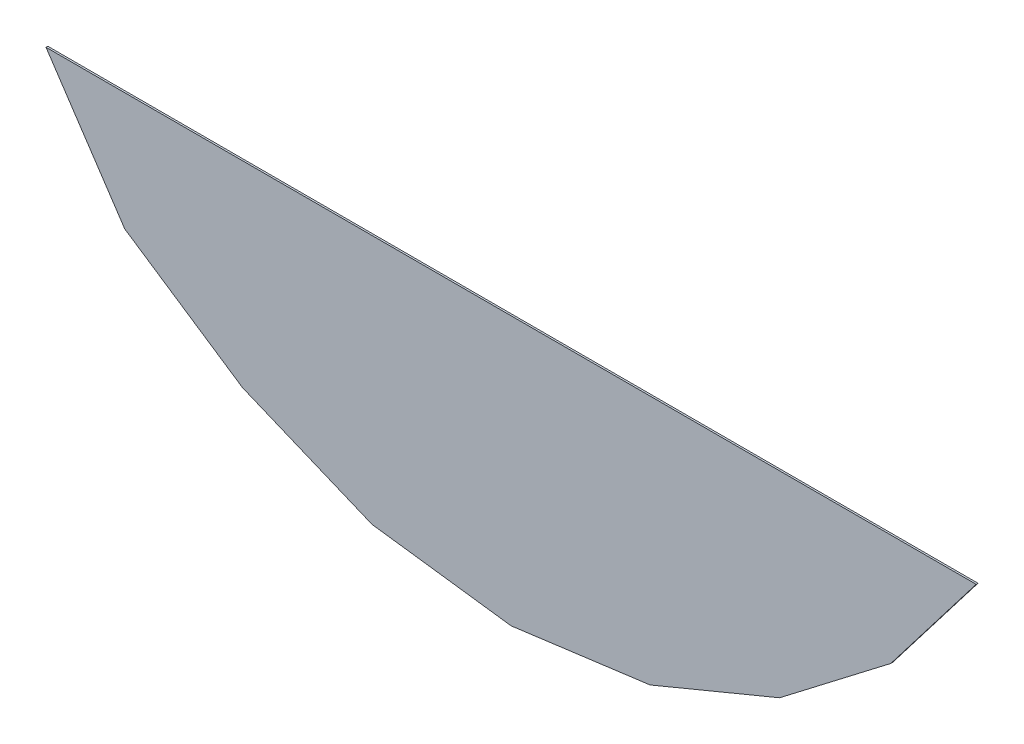
ISO-10303-21;
HEADER;
FILE_DESCRIPTION(('STEP AP214'),'2;1');
FILE_NAME('part.step','',(''),(''),'','','');
FILE_SCHEMA(('AUTOMOTIVE_DESIGN { 1 0 10303 214 1 1 1 1 }'));
ENDSEC;
DATA;
#1=APPLICATION_CONTEXT('core data for automotive mechanical design processes');
#2=APPLICATION_PROTOCOL_DEFINITION('international standard','automotive_design',2000,#1);
#3=PRODUCT_CONTEXT('',#1,'mechanical');
#4=PRODUCT('Part','Part','',(#3));
#5=PRODUCT_RELATED_PRODUCT_CATEGORY('part','',(#4));
#6=PRODUCT_DEFINITION_FORMATION('','',#4);
#7=PRODUCT_DEFINITION_CONTEXT('part definition',#1,'design');
#8=PRODUCT_DEFINITION('design','',#6,#7);
#9=PRODUCT_DEFINITION_SHAPE('','',#8);
#10=(LENGTH_UNIT() NAMED_UNIT(*) SI_UNIT(.MILLI.,.METRE.));
#11=(NAMED_UNIT(*) PLANE_ANGLE_UNIT() SI_UNIT($,.RADIAN.));
#12=(NAMED_UNIT(*) SI_UNIT($,.STERADIAN.) SOLID_ANGLE_UNIT());
#13=UNCERTAINTY_MEASURE_WITH_UNIT(LENGTH_MEASURE(1.E-05),#10,'distance_accuracy_value','');
#14=(GEOMETRIC_REPRESENTATION_CONTEXT(3) GLOBAL_UNCERTAINTY_ASSIGNED_CONTEXT((#13)) GLOBAL_UNIT_ASSIGNED_CONTEXT((#10,
#11,#12)) REPRESENTATION_CONTEXT('',''));
#15=CARTESIAN_POINT('',(0.,0.,0.));
#16=DIRECTION('',(0.,0.,1.));
#17=DIRECTION('',(1.,0.,0.));
#18=AXIS2_PLACEMENT_3D('',#15,#16,#17);
#19=CARTESIAN_POINT('',(-2.55477772,-4.28920148,3.9099998));
#20=DIRECTION('',(0.,0.,1.));
#21=DIRECTION('',(1.,0.,0.));
#22=AXIS2_PLACEMENT_3D('',#19,#20,#21);
#23=PLANE('',#22);
#24=DIRECTION('',(0.608760808228314,0.793353816632409,0.));
#25=VECTOR('',#24,1.);
#26=CARTESIAN_POINT('',(2.55477264,-4.28920148,3.9099998));
#27=LINE('',#26,#25);
#28=CARTESIAN_POINT('',(2.55477264,-4.28920148,3.9099998));
#29=VERTEX_POINT('',#28);
#30=CARTESIAN_POINT('',(2.08596230000002,-4.90016800000001,3.9099998));
#31=VERTEX_POINT('',#30);
#32=EDGE_CURVE('E126',#29,#31,#27,.F.);
#33=ORIENTED_EDGE('',*,*,#32,.F.);
#34=DIRECTION('',(1.,0.,0.));
#35=VECTOR('',#34,1.);
#36=CARTESIAN_POINT('',(-2.55477772,-4.28920148,3.9099998));
#37=LINE('',#36,#35);
#38=CARTESIAN_POINT('',(-2.55477772000007,-4.28920148000005,3.9099998));
#39=VERTEX_POINT('',#38);
#40=EDGE_CURVE('E99',#39,#29,#37,.T.);
#41=ORIENTED_EDGE('',*,*,#40,.F.);
#42=DIRECTION('',(0.555139797690197,-0.831757058894295,0.));
#43=VECTOR('',#42,1.);
#44=CARTESIAN_POINT('',(-2.12257132,-4.9367694,3.9099998));
#45=LINE('',#44,#43);
#46=CARTESIAN_POINT('',(-2.12257131999998,-4.93676939999997,3.9099998));
#47=VERTEX_POINT('',#46);
#48=EDGE_CURVE('E19',#47,#39,#45,.F.);
#49=ORIENTED_EDGE('',*,*,#48,.F.);
#50=DIRECTION('',(0.831757058894295,-0.555139797690197,0.));
#51=VECTOR('',#50,1.);
#52=CARTESIAN_POINT('',(-1.4750034,-5.3689758,3.9099998));
#53=LINE('',#52,#51);
#54=CARTESIAN_POINT('',(-1.47500340000004,-5.36897580000008,3.9099998));
#55=VERTEX_POINT('',#54);
#56=EDGE_CURVE('E88',#55,#47,#53,.F.);
#57=ORIENTED_EDGE('',*,*,#56,.F.);
#58=DIRECTION('',(0.923879753352857,-0.382682899205941,0.));
#59=VECTOR('',#58,1.);
#60=CARTESIAN_POINT('',(-0.76351892,-5.66368184,3.9099998));
#61=LINE('',#60,#59);
#62=CARTESIAN_POINT('',(-0.763518920000012,-5.66368184000008,3.9099998));
#63=VERTEX_POINT('',#62);
#64=EDGE_CURVE('E83',#63,#55,#61,.F.);
#65=ORIENTED_EDGE('',*,*,#64,.F.);
#66=DIRECTION('',(0.991445008976821,-0.130525071058976,0.));
#67=VECTOR('',#66,1.);
#68=CARTESIAN_POINT('',(-2.539999996998E-06,-5.7641998,3.9099998));
#69=LINE('',#68,#67);
#70=CARTESIAN_POINT('',(-2.5400000081571E-06,-5.76419979999992,3.9099998));
#71=VERTEX_POINT('',#70);
#72=EDGE_CURVE('E110',#71,#63,#69,.F.);
#73=ORIENTED_EDGE('',*,*,#72,.F.);
#74=DIRECTION('',(0.991445008976821,0.130525071058976,0.));
#75=VECTOR('',#74,1.);
#76=CARTESIAN_POINT('',(0.76351384,-5.66368184,3.9099998));
#77=LINE('',#76,#75);
#78=CARTESIAN_POINT('',(0.763513839999964,-5.66368183999992,3.9099998));
#79=VERTEX_POINT('',#78);
#80=EDGE_CURVE('E114',#79,#71,#77,.F.);
#81=ORIENTED_EDGE('',*,*,#80,.F.);
#82=DIRECTION('',(0.923879753352857,0.382682899205941,0.));
#83=VECTOR('',#82,1.);
#84=CARTESIAN_POINT('',(1.47499832,-5.3689758,3.9099998));
#85=LINE('',#84,#83);
#86=CARTESIAN_POINT('',(1.47499832000001,-5.36897580000001,3.9099998));
#87=VERTEX_POINT('',#86);
#88=EDGE_CURVE('E118',#87,#79,#85,.F.);
#89=ORIENTED_EDGE('',*,*,#88,.F.);
#90=DIRECTION('',(0.793354187267769,0.608760325205822,0.));
#91=VECTOR('',#90,1.);
#92=CARTESIAN_POINT('',(2.0859623,-4.900168,3.9099998));
#93=LINE('',#92,#91);
#94=EDGE_CURVE('E122',#31,#87,#93,.F.);
#95=ORIENTED_EDGE('',*,*,#94,.F.);
#96=EDGE_LOOP('',(#33,#41,#49,#57,#65,#73,#81,#89,#95));
#97=FACE_BOUND('',#96,.T.);
#98=ADVANCED_FACE('F16',(#97),#23,.T.);
#99=CARTESIAN_POINT('',(-2.12257132,-4.9367694,3.89999982));
#100=DIRECTION('',(-0.831757058894295,-0.555139797690197,0.));
#101=DIRECTION('',(0.555139797690197,-0.831757058894295,0.));
#102=AXIS2_PLACEMENT_3D('',#99,#100,#101);
#103=PLANE('',#102);
#104=DIRECTION('',(0.,0.,1.));
#105=VECTOR('',#104,1.);
#106=CARTESIAN_POINT('',(-2.55477772,-4.28920148,3.89999982));
#107=LINE('',#106,#105);
#108=CARTESIAN_POINT('',(-2.55477772000007,-4.28920148000005,3.89999982));
#109=VERTEX_POINT('',#108);
#110=EDGE_CURVE('E130',#109,#39,#107,.T.);
#111=ORIENTED_EDGE('',*,*,#110,.F.);
#112=DIRECTION('',(0.555139797690014,-0.831757058894417,0.));
#113=VECTOR('',#112,1.);
#114=CARTESIAN_POINT('',(-2.55477772,-4.28920148,3.89999982));
#115=LINE('',#114,#113);
#116=CARTESIAN_POINT('',(-2.12257131999998,-4.93676939999997,3.89999982));
#117=VERTEX_POINT('',#116);
#118=EDGE_CURVE('E105',#109,#117,#115,.T.);
#119=ORIENTED_EDGE('',*,*,#118,.T.);
#120=DIRECTION('',(0.,0.,1.));
#121=VECTOR('',#120,1.);
#122=CARTESIAN_POINT('',(-2.12257131999991,-4.93676939999986,3.89999982));
#123=LINE('',#122,#121);
#124=EDGE_CURVE('E93',#47,#117,#123,.F.);
#125=ORIENTED_EDGE('',*,*,#124,.F.);
#126=ORIENTED_EDGE('',*,*,#48,.T.);
#127=EDGE_LOOP('',(#111,#119,#125,#126));
#128=FACE_BOUND('',#127,.T.);
#129=ADVANCED_FACE('F104',(#128),#103,.T.);
#130=CARTESIAN_POINT('',(-1.4750034,-5.3689758,3.89999982));
#131=DIRECTION('',(-0.555139797690197,-0.831757058894295,0.));
#132=DIRECTION('',(0.831757058894295,-0.555139797690197,0.));
#133=AXIS2_PLACEMENT_3D('',#130,#131,#132);
#134=PLANE('',#133);
#135=ORIENTED_EDGE('',*,*,#124,.T.);
#136=DIRECTION('',(0.831757058894417,-0.555139797690014,0.));
#137=VECTOR('',#136,1.);
#138=CARTESIAN_POINT('',(-2.12257132,-4.9367694,3.89999982));
#139=LINE('',#138,#137);
#140=CARTESIAN_POINT('',(-1.47500340000004,-5.36897580000008,3.89999982));
#141=VERTEX_POINT('',#140);
#142=EDGE_CURVE('E135',#117,#141,#139,.T.);
#143=ORIENTED_EDGE('',*,*,#142,.T.);
#144=DIRECTION('',(0.,0.,1.));
#145=VECTOR('',#144,1.);
#146=CARTESIAN_POINT('',(-1.47500340000014,-5.36897580000034,3.89999982));
#147=LINE('',#146,#145);
#148=EDGE_CURVE('E95',#55,#141,#147,.F.);
#149=ORIENTED_EDGE('',*,*,#148,.F.);
#150=ORIENTED_EDGE('',*,*,#56,.T.);
#151=EDGE_LOOP('',(#135,#143,#149,#150));
#152=FACE_BOUND('',#151,.T.);
#153=ADVANCED_FACE('F90',(#152),#134,.T.);
#154=CARTESIAN_POINT('',(-0.76351892,-5.66368184,3.89999982));
#155=DIRECTION('',(-0.382682899205941,-0.923879753352857,0.));
#156=DIRECTION('',(0.923879753352857,-0.382682899205941,0.));
#157=AXIS2_PLACEMENT_3D('',#154,#155,#156);
#158=PLANE('',#157);
#159=ORIENTED_EDGE('',*,*,#148,.T.);
#160=DIRECTION('',(0.923879753352675,-0.382682899206379,0.));
#161=VECTOR('',#160,1.);
#162=CARTESIAN_POINT('',(-1.4750034,-5.3689758,3.89999982));
#163=LINE('',#162,#161);
#164=CARTESIAN_POINT('',(-0.763518920000012,-5.66368184000008,3.89999982));
#165=VERTEX_POINT('',#164);
#166=EDGE_CURVE('E137',#141,#165,#163,.T.);
#167=ORIENTED_EDGE('',*,*,#166,.T.);
#168=DIRECTION('',(0.,0.,1.));
#169=VECTOR('',#168,1.);
#170=CARTESIAN_POINT('',(-0.763518920000045,-5.66368184000034,3.89999982));
#171=LINE('',#170,#169);
#172=EDGE_CURVE('E112',#63,#165,#171,.F.);
#173=ORIENTED_EDGE('',*,*,#172,.F.);
#174=ORIENTED_EDGE('',*,*,#64,.T.);
#175=EDGE_LOOP('',(#159,#167,#173,#174));
#176=FACE_BOUND('',#175,.T.);
#177=ADVANCED_FACE('F179',(#176),#158,.T.);
#178=CARTESIAN_POINT('',(-2.539999996998E-06,-5.7641998,3.89999982));
#179=DIRECTION('',(-0.130525071058976,-0.991445008976821,0.));
#180=DIRECTION('',(0.991445008976821,-0.130525071058976,0.));
#181=AXIS2_PLACEMENT_3D('',#178,#179,#180);
#182=PLANE('',#181);
#183=ORIENTED_EDGE('',*,*,#172,.T.);
#184=DIRECTION('',(0.991445008976764,-0.130525071059414,0.));
#185=VECTOR('',#184,1.);
#186=CARTESIAN_POINT('',(-0.76351892,-5.66368184,3.89999982));
#187=LINE('',#186,#185);
#188=CARTESIAN_POINT('',(-2.54000000815547E-06,-5.76419979999992,3.89999982));
#189=VERTEX_POINT('',#188);
#190=EDGE_CURVE('E140',#165,#189,#187,.T.);
#191=ORIENTED_EDGE('',*,*,#190,.T.);
#192=DIRECTION('',(0.,0.,1.));
#193=VECTOR('',#192,1.);
#194=CARTESIAN_POINT('',(-2.5400000415671E-06,-5.76419979999966,3.89999982));
#195=LINE('',#194,#193);
#196=EDGE_CURVE('E116',#71,#189,#195,.F.);
#197=ORIENTED_EDGE('',*,*,#196,.F.);
#198=ORIENTED_EDGE('',*,*,#72,.T.);
#199=EDGE_LOOP('',(#183,#191,#197,#198));
#200=FACE_BOUND('',#199,.T.);
#201=ADVANCED_FACE('F177',(#200),#182,.T.);
#202=CARTESIAN_POINT('',(0.76351384,-5.66368184,3.89999982));
#203=DIRECTION('',(0.130525071058976,-0.991445008976821,0.));
#204=DIRECTION('',(0.991445008976821,0.130525071058976,0.));
#205=AXIS2_PLACEMENT_3D('',#202,#203,#204);
#206=PLANE('',#205);
#207=ORIENTED_EDGE('',*,*,#196,.T.);
#208=DIRECTION('',(0.991445008976763,0.130525071059415,0.));
#209=VECTOR('',#208,1.);
#210=CARTESIAN_POINT('',(-2.53999999678955E-06,-5.7641998,3.89999982));
#211=LINE('',#210,#209);
#212=CARTESIAN_POINT('',(0.763513839999964,-5.66368183999992,3.89999982));
#213=VERTEX_POINT('',#212);
#214=EDGE_CURVE('E143',#189,#213,#211,.T.);
#215=ORIENTED_EDGE('',*,*,#214,.T.);
#216=DIRECTION('',(0.,0.,1.));
#217=VECTOR('',#216,1.);
#218=CARTESIAN_POINT('',(0.76351383999986,-5.66368183999966,3.89999982));
#219=LINE('',#218,#217);
#220=EDGE_CURVE('E120',#79,#213,#219,.F.);
#221=ORIENTED_EDGE('',*,*,#220,.F.);
#222=ORIENTED_EDGE('',*,*,#80,.T.);
#223=EDGE_LOOP('',(#207,#215,#221,#222));
#224=FACE_BOUND('',#223,.T.);
#225=ADVANCED_FACE('F173',(#224),#206,.T.);
#226=CARTESIAN_POINT('',(1.47499832,-5.3689758,3.89999982));
#227=DIRECTION('',(0.382682899205941,-0.923879753352857,0.));
#228=DIRECTION('',(0.923879753352857,0.382682899205941,0.));
#229=AXIS2_PLACEMENT_3D('',#226,#227,#228);
#230=PLANE('',#229);
#231=ORIENTED_EDGE('',*,*,#220,.T.);
#232=DIRECTION('',(0.923879753352675,0.382682899206379,0.));
#233=VECTOR('',#232,1.);
#234=CARTESIAN_POINT('',(0.76351384,-5.66368184,3.89999982));
#235=LINE('',#234,#233);
#236=CARTESIAN_POINT('',(1.47499832000001,-5.36897580000001,3.89999982));
#237=VERTEX_POINT('',#236);
#238=EDGE_CURVE('E146',#213,#237,#235,.T.);
#239=ORIENTED_EDGE('',*,*,#238,.T.);
#240=DIRECTION('',(0.,0.,1.));
#241=VECTOR('',#240,1.);
#242=CARTESIAN_POINT('',(1.47499832000003,-5.36897580000004,3.89999982));
#243=LINE('',#242,#241);
#244=EDGE_CURVE('E124',#87,#237,#243,.F.);
#245=ORIENTED_EDGE('',*,*,#244,.F.);
#246=ORIENTED_EDGE('',*,*,#88,.T.);
#247=EDGE_LOOP('',(#231,#239,#245,#246));
#248=FACE_BOUND('',#247,.T.);
#249=ADVANCED_FACE('F167',(#248),#230,.T.);
#250=CARTESIAN_POINT('',(2.0859623,-4.900168,3.89999982));
#251=DIRECTION('',(0.608760325205822,-0.793354187267769,0.));
#252=DIRECTION('',(0.793354187267769,0.608760325205822,0.));
#253=AXIS2_PLACEMENT_3D('',#250,#251,#252);
#254=PLANE('',#253);
#255=ORIENTED_EDGE('',*,*,#244,.T.);
#256=DIRECTION('',(0.79335418726781,0.608760325205768,0.));
#257=VECTOR('',#256,1.);
#258=CARTESIAN_POINT('',(1.47499832,-5.3689758,3.89999982));
#259=LINE('',#258,#257);
#260=CARTESIAN_POINT('',(2.08596230000002,-4.90016800000001,3.89999982));
#261=VERTEX_POINT('',#260);
#262=EDGE_CURVE('E149',#237,#261,#259,.T.);
#263=ORIENTED_EDGE('',*,*,#262,.T.);
#264=DIRECTION('',(0.,0.,1.));
#265=VECTOR('',#264,1.);
#266=CARTESIAN_POINT('',(2.08596230000008,-4.90016800000006,3.89999982));
#267=LINE('',#266,#265);
#268=EDGE_CURVE('E128',#31,#261,#267,.F.);
#269=ORIENTED_EDGE('',*,*,#268,.F.);
#270=ORIENTED_EDGE('',*,*,#94,.T.);
#271=EDGE_LOOP('',(#255,#263,#269,#270));
#272=FACE_BOUND('',#271,.T.);
#273=ADVANCED_FACE('F162',(#272),#254,.T.);
#274=CARTESIAN_POINT('',(2.55477264,-4.28920148,3.89999982));
#275=DIRECTION('',(0.793353816632409,-0.608760808228314,0.));
#276=DIRECTION('',(0.608760808228314,0.793353816632409,0.));
#277=AXIS2_PLACEMENT_3D('',#274,#275,#276);
#278=PLANE('',#277);
#279=ORIENTED_EDGE('',*,*,#268,.T.);
#280=DIRECTION('',(0.608760808228414,0.793353816632332,0.));
#281=VECTOR('',#280,1.);
#282=CARTESIAN_POINT('',(2.0859623,-4.900168,3.89999982));
#283=LINE('',#282,#281);
#284=CARTESIAN_POINT('',(2.55477264,-4.28920148,3.89999982));
#285=VERTEX_POINT('',#284);
#286=EDGE_CURVE('E25',#261,#285,#283,.T.);
#287=ORIENTED_EDGE('',*,*,#286,.T.);
#288=DIRECTION('',(0.,0.,1.));
#289=VECTOR('',#288,1.);
#290=CARTESIAN_POINT('',(2.55477264,-4.28920148,3.89999982));
#291=LINE('',#290,#289);
#292=EDGE_CURVE('E33',#29,#285,#291,.F.);
#293=ORIENTED_EDGE('',*,*,#292,.F.);
#294=ORIENTED_EDGE('',*,*,#32,.T.);
#295=EDGE_LOOP('',(#279,#287,#293,#294));
#296=FACE_BOUND('',#295,.T.);
#297=ADVANCED_FACE('F155',(#296),#278,.T.);
#298=CARTESIAN_POINT('',(-2.55477772,-4.28920148,3.89999982));
#299=DIRECTION('',(0.,1.,0.));
#300=DIRECTION('',(0.,0.,1.));
#301=AXIS2_PLACEMENT_3D('',#298,#299,#300);
#302=PLANE('',#301);
#303=ORIENTED_EDGE('',*,*,#292,.T.);
#304=DIRECTION('',(1.,0.,0.));
#305=VECTOR('',#304,1.);
#306=CARTESIAN_POINT('',(-2.55477772,-4.28920148,3.89999982));
#307=LINE('',#306,#305);
#308=EDGE_CURVE('E11',#285,#109,#307,.F.);
#309=ORIENTED_EDGE('',*,*,#308,.T.);
#310=ORIENTED_EDGE('',*,*,#110,.T.);
#311=ORIENTED_EDGE('',*,*,#40,.T.);
#312=EDGE_LOOP('',(#303,#309,#310,#311));
#313=FACE_BOUND('',#312,.T.);
#314=ADVANCED_FACE('F190',(#313),#302,.T.);
#315=CARTESIAN_POINT('',(-2.55477772,-4.28920148,3.89999982));
#316=DIRECTION('',(0.,0.,1.));
#317=DIRECTION('',(1.,0.,0.));
#318=AXIS2_PLACEMENT_3D('',#315,#316,#317);
#319=PLANE('',#318);
#320=ORIENTED_EDGE('',*,*,#286,.F.);
#321=ORIENTED_EDGE('',*,*,#262,.F.);
#322=ORIENTED_EDGE('',*,*,#238,.F.);
#323=ORIENTED_EDGE('',*,*,#214,.F.);
#324=ORIENTED_EDGE('',*,*,#190,.F.);
#325=ORIENTED_EDGE('',*,*,#166,.F.);
#326=ORIENTED_EDGE('',*,*,#142,.F.);
#327=ORIENTED_EDGE('',*,*,#118,.F.);
#328=ORIENTED_EDGE('',*,*,#308,.F.);
#329=EDGE_LOOP('',(#320,#321,#322,#323,#324,#325,#326,#327,#328));
#330=FACE_BOUND('',#329,.T.);
#331=ADVANCED_FACE('F159',(#330),#319,.F.);
#332=CLOSED_SHELL('',(#98,#129,#153,#177,#201,#225,#249,#273,#297,#314,#331));
#333=MANIFOLD_SOLID_BREP('B1',#332);
#334=ADVANCED_BREP_SHAPE_REPRESENTATION('',(#18,#333),#14);
#335=SHAPE_DEFINITION_REPRESENTATION(#9,#334);
ENDSEC;
END-ISO-10303-21;
